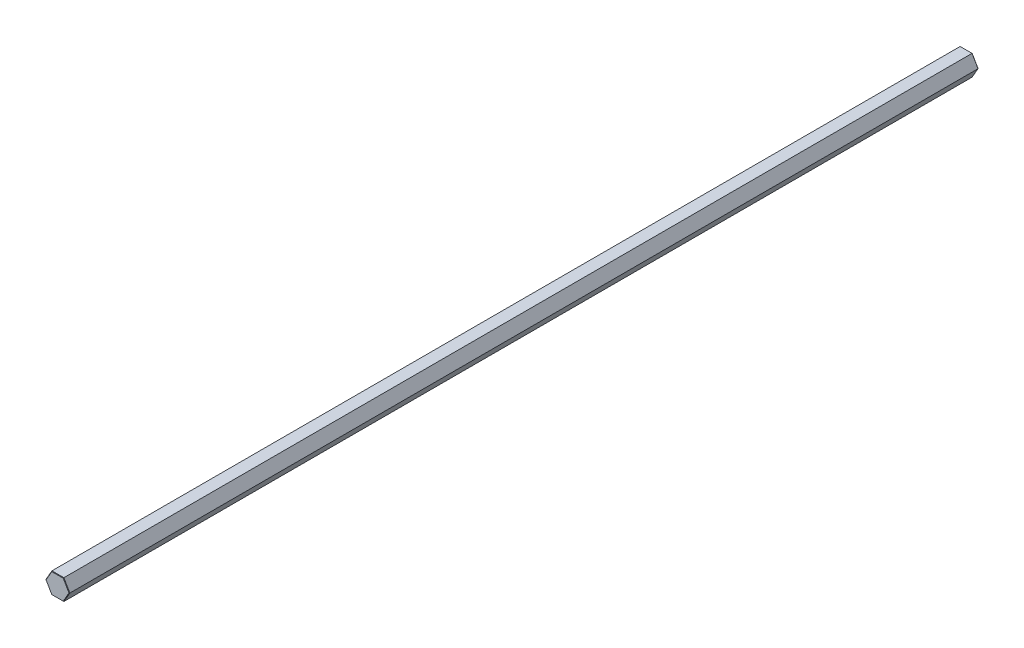
ISO-10303-21;
HEADER;
FILE_DESCRIPTION(('STEP AP214'),'2;1');
FILE_NAME('part.step','',(''),(''),'','','');
FILE_SCHEMA(('AUTOMOTIVE_DESIGN { 1 0 10303 214 1 1 1 1 }'));
ENDSEC;
DATA;
#1=APPLICATION_CONTEXT('core data for automotive mechanical design processes');
#2=APPLICATION_PROTOCOL_DEFINITION('international standard','automotive_design',2000,#1);
#3=PRODUCT_CONTEXT('',#1,'mechanical');
#4=PRODUCT('Part','Part','',(#3));
#5=PRODUCT_RELATED_PRODUCT_CATEGORY('part','',(#4));
#6=PRODUCT_DEFINITION_FORMATION('','',#4);
#7=PRODUCT_DEFINITION_CONTEXT('part definition',#1,'design');
#8=PRODUCT_DEFINITION('design','',#6,#7);
#9=PRODUCT_DEFINITION_SHAPE('','',#8);
#10=(LENGTH_UNIT() NAMED_UNIT(*) SI_UNIT(.MILLI.,.METRE.));
#11=(NAMED_UNIT(*) PLANE_ANGLE_UNIT() SI_UNIT($,.RADIAN.));
#12=(NAMED_UNIT(*) SI_UNIT($,.STERADIAN.) SOLID_ANGLE_UNIT());
#13=UNCERTAINTY_MEASURE_WITH_UNIT(LENGTH_MEASURE(1.E-05),#10,'distance_accuracy_value','');
#14=(GEOMETRIC_REPRESENTATION_CONTEXT(3) GLOBAL_UNCERTAINTY_ASSIGNED_CONTEXT((#13)) GLOBAL_UNIT_ASSIGNED_CONTEXT((#10,
#11,#12)) REPRESENTATION_CONTEXT('',''));
#15=CARTESIAN_POINT('',(0.,0.,0.));
#16=DIRECTION('',(0.,0.,1.));
#17=DIRECTION('',(1.,0.,0.));
#18=AXIS2_PLACEMENT_3D('',#15,#16,#17);
#19=CARTESIAN_POINT('',(-7.33234841870824,0.,558.8));
#20=DIRECTION('',(-0.866025403784439,0.5,0.));
#21=DIRECTION('',(-0.5,-0.866025403784439,0.));
#22=AXIS2_PLACEMENT_3D('',#19,#20,#21);
#23=PLANE('',#22);
#24=DIRECTION('',(0.,0.,-1.));
#25=VECTOR('',#24,1.);
#26=CARTESIAN_POINT('',(-3.66617420935412,6.35,558.8));
#27=LINE('',#26,#25);
#28=CARTESIAN_POINT('',(-3.66617420935412,6.35,558.546));
#29=VERTEX_POINT('',#28);
#30=CARTESIAN_POINT('',(-3.66617420935412,6.35,0.253999999999976));
#31=VERTEX_POINT('',#30);
#32=EDGE_CURVE('E157',#29,#31,#27,.T.);
#33=ORIENTED_EDGE('',*,*,#32,.T.);
#34=DIRECTION('',(-0.5,-0.866025403784439,0.));
#35=VECTOR('',#34,1.);
#36=CARTESIAN_POINT('',(-7.33234841870824,0.,0.253999999999976));
#37=LINE('',#36,#35);
#38=CARTESIAN_POINT('',(-7.33234841870824,0.,0.253999999999976));
#39=VERTEX_POINT('',#38);
#40=EDGE_CURVE('E154',#31,#39,#37,.T.);
#41=ORIENTED_EDGE('',*,*,#40,.T.);
#42=DIRECTION('',(0.,0.,-1.));
#43=VECTOR('',#42,1.);
#44=CARTESIAN_POINT('',(-7.33234841870824,0.,558.8));
#45=LINE('',#44,#43);
#46=CARTESIAN_POINT('',(-7.33234841870824,0.,558.546));
#47=VERTEX_POINT('',#46);
#48=EDGE_CURVE('E151',#47,#39,#45,.T.);
#49=ORIENTED_EDGE('',*,*,#48,.F.);
#50=DIRECTION('',(0.5,0.866025403784439,0.));
#51=VECTOR('',#50,1.);
#52=CARTESIAN_POINT('',(-3.66617420935412,6.35,558.546));
#53=LINE('',#52,#51);
#54=EDGE_CURVE('E211',#47,#29,#53,.T.);
#55=ORIENTED_EDGE('',*,*,#54,.T.);
#56=EDGE_LOOP('',(#33,#41,#49,#55));
#57=FACE_BOUND('',#56,.T.);
#58=ADVANCED_FACE('F36',(#57),#23,.T.);
#59=CARTESIAN_POINT('',(-3.66617420935412,-6.35,558.8));
#60=DIRECTION('',(-0.866025403784439,-0.5,0.));
#61=DIRECTION('',(0.5,-0.866025403784439,0.));
#62=AXIS2_PLACEMENT_3D('',#59,#60,#61);
#63=PLANE('',#62);
#64=ORIENTED_EDGE('',*,*,#48,.T.);
#65=DIRECTION('',(0.5,-0.866025403784439,0.));
#66=VECTOR('',#65,1.);
#67=CARTESIAN_POINT('',(-3.66617420935412,-6.35,0.253999999999976));
#68=LINE('',#67,#66);
#69=CARTESIAN_POINT('',(-3.66617420935412,-6.35,0.253999999999976));
#70=VERTEX_POINT('',#69);
#71=EDGE_CURVE('E195',#39,#70,#68,.T.);
#72=ORIENTED_EDGE('',*,*,#71,.T.);
#73=DIRECTION('',(0.,0.,-1.));
#74=VECTOR('',#73,1.);
#75=CARTESIAN_POINT('',(-3.66617420935412,-6.35,558.8));
#76=LINE('',#75,#74);
#77=CARTESIAN_POINT('',(-3.66617420935412,-6.35,558.546));
#78=VERTEX_POINT('',#77);
#79=EDGE_CURVE('E274',#78,#70,#76,.T.);
#80=ORIENTED_EDGE('',*,*,#79,.F.);
#81=DIRECTION('',(-0.5,0.866025403784439,0.));
#82=VECTOR('',#81,1.);
#83=CARTESIAN_POINT('',(-7.33234841870824,0.,558.546));
#84=LINE('',#83,#82);
#85=EDGE_CURVE('E201',#78,#47,#84,.T.);
#86=ORIENTED_EDGE('',*,*,#85,.T.);
#87=EDGE_LOOP('',(#64,#72,#80,#86));
#88=FACE_BOUND('',#87,.T.);
#89=ADVANCED_FACE('F277',(#88),#63,.T.);
#90=CARTESIAN_POINT('',(3.66617420935413,-6.35,558.8));
#91=DIRECTION('',(0.,-1.,0.));
#92=DIRECTION('',(0.,0.,-1.));
#93=AXIS2_PLACEMENT_3D('',#90,#91,#92);
#94=PLANE('',#93);
#95=ORIENTED_EDGE('',*,*,#79,.T.);
#96=DIRECTION('',(1.,0.,0.));
#97=VECTOR('',#96,1.);
#98=CARTESIAN_POINT('',(3.66617420935413,-6.35,0.253999999999976));
#99=LINE('',#98,#97);
#100=CARTESIAN_POINT('',(3.66617420935413,-6.35,0.253999999999976));
#101=VERTEX_POINT('',#100);
#102=EDGE_CURVE('E234',#70,#101,#99,.T.);
#103=ORIENTED_EDGE('',*,*,#102,.T.);
#104=DIRECTION('',(0.,0.,-1.));
#105=VECTOR('',#104,1.);
#106=CARTESIAN_POINT('',(3.66617420935413,-6.35,558.8));
#107=LINE('',#106,#105);
#108=CARTESIAN_POINT('',(3.66617420935413,-6.35,558.546));
#109=VERTEX_POINT('',#108);
#110=EDGE_CURVE('E251',#109,#101,#107,.T.);
#111=ORIENTED_EDGE('',*,*,#110,.F.);
#112=DIRECTION('',(-1.,0.,0.));
#113=VECTOR('',#112,1.);
#114=CARTESIAN_POINT('',(-3.66617420935412,-6.35,558.546));
#115=LINE('',#114,#113);
#116=EDGE_CURVE('E231',#109,#78,#115,.T.);
#117=ORIENTED_EDGE('',*,*,#116,.T.);
#118=EDGE_LOOP('',(#95,#103,#111,#117));
#119=FACE_BOUND('',#118,.T.);
#120=ADVANCED_FACE('F302',(#119),#94,.T.);
#121=CARTESIAN_POINT('',(7.33234841870825,0.,558.8));
#122=DIRECTION('',(0.866025403784439,-0.5,0.));
#123=DIRECTION('',(0.5,0.866025403784439,0.));
#124=AXIS2_PLACEMENT_3D('',#121,#122,#123);
#125=PLANE('',#124);
#126=ORIENTED_EDGE('',*,*,#110,.T.);
#127=DIRECTION('',(0.5,0.866025403784439,0.));
#128=VECTOR('',#127,1.);
#129=CARTESIAN_POINT('',(7.33234841870825,0.,0.253999999999976));
#130=LINE('',#129,#128);
#131=CARTESIAN_POINT('',(7.33234841870825,0.,0.253999999999976));
#132=VERTEX_POINT('',#131);
#133=EDGE_CURVE('E206',#101,#132,#130,.T.);
#134=ORIENTED_EDGE('',*,*,#133,.T.);
#135=DIRECTION('',(0.,0.,-1.));
#136=VECTOR('',#135,1.);
#137=CARTESIAN_POINT('',(7.33234841870825,0.,558.8));
#138=LINE('',#137,#136);
#139=CARTESIAN_POINT('',(7.33234841870825,0.,558.546));
#140=VERTEX_POINT('',#139);
#141=EDGE_CURVE('E250',#140,#132,#138,.T.);
#142=ORIENTED_EDGE('',*,*,#141,.F.);
#143=DIRECTION('',(-0.5,-0.866025403784439,0.));
#144=VECTOR('',#143,1.);
#145=CARTESIAN_POINT('',(3.66617420935413,-6.35,558.546));
#146=LINE('',#145,#144);
#147=EDGE_CURVE('E238',#140,#109,#146,.T.);
#148=ORIENTED_EDGE('',*,*,#147,.T.);
#149=EDGE_LOOP('',(#126,#134,#142,#148));
#150=FACE_BOUND('',#149,.T.);
#151=ADVANCED_FACE('F249',(#150),#125,.T.);
#152=CARTESIAN_POINT('',(3.66617420935413,6.35,558.8));
#153=DIRECTION('',(0.866025403784439,0.5,0.));
#154=DIRECTION('',(-0.5,0.866025403784439,0.));
#155=AXIS2_PLACEMENT_3D('',#152,#153,#154);
#156=PLANE('',#155);
#157=ORIENTED_EDGE('',*,*,#141,.T.);
#158=DIRECTION('',(-0.5,0.866025403784439,0.));
#159=VECTOR('',#158,1.);
#160=CARTESIAN_POINT('',(3.66617420935413,6.35,0.253999999999976));
#161=LINE('',#160,#159);
#162=CARTESIAN_POINT('',(3.66617420935413,6.35,0.253999999999976));
#163=VERTEX_POINT('',#162);
#164=EDGE_CURVE('E203',#132,#163,#161,.T.);
#165=ORIENTED_EDGE('',*,*,#164,.T.);
#166=DIRECTION('',(0.,0.,-1.));
#167=VECTOR('',#166,1.);
#168=CARTESIAN_POINT('',(3.66617420935413,6.35,558.8));
#169=LINE('',#168,#167);
#170=CARTESIAN_POINT('',(3.66617420935413,6.35,558.546));
#171=VERTEX_POINT('',#170);
#172=EDGE_CURVE('E260',#171,#163,#169,.T.);
#173=ORIENTED_EDGE('',*,*,#172,.F.);
#174=DIRECTION('',(0.5,-0.866025403784439,0.));
#175=VECTOR('',#174,1.);
#176=CARTESIAN_POINT('',(7.33234841870825,0.,558.546));
#177=LINE('',#176,#175);
#178=EDGE_CURVE('E200',#171,#140,#177,.T.);
#179=ORIENTED_EDGE('',*,*,#178,.T.);
#180=EDGE_LOOP('',(#157,#165,#173,#179));
#181=FACE_BOUND('',#180,.T.);
#182=ADVANCED_FACE('F256',(#181),#156,.T.);
#183=CARTESIAN_POINT('',(-3.66617420935412,6.35,558.8));
#184=DIRECTION('',(0.,1.,0.));
#185=DIRECTION('',(0.,0.,1.));
#186=AXIS2_PLACEMENT_3D('',#183,#184,#185);
#187=PLANE('',#186);
#188=ORIENTED_EDGE('',*,*,#172,.T.);
#189=DIRECTION('',(-1.,0.,0.));
#190=VECTOR('',#189,1.);
#191=CARTESIAN_POINT('',(-3.66617420935412,6.35,0.253999999999976));
#192=LINE('',#191,#190);
#193=EDGE_CURVE('E216',#163,#31,#192,.T.);
#194=ORIENTED_EDGE('',*,*,#193,.T.);
#195=ORIENTED_EDGE('',*,*,#32,.F.);
#196=DIRECTION('',(1.,0.,0.));
#197=VECTOR('',#196,1.);
#198=CARTESIAN_POINT('',(3.66617420935413,6.35,558.546));
#199=LINE('',#198,#197);
#200=EDGE_CURVE('E214',#29,#171,#199,.T.);
#201=ORIENTED_EDGE('',*,*,#200,.T.);
#202=EDGE_LOOP('',(#188,#194,#195,#201));
#203=FACE_BOUND('',#202,.T.);
#204=ADVANCED_FACE('F282',(#203),#187,.T.);
#205=CARTESIAN_POINT('',(0.,0.,558.8));
#206=DIRECTION('',(0.,0.,-1.));
#207=DIRECTION('',(-1.,0.,0.));
#208=AXIS2_PLACEMENT_3D('',#205,#206,#207);
#209=PLANE('',#208);
#210=DIRECTION('',(-0.5,-0.866025403784439,0.));
#211=VECTOR('',#210,1.);
#212=CARTESIAN_POINT('',(-7.11237796614707,-0.126999999999954,558.8));
#213=LINE('',#212,#211);
#214=CARTESIAN_POINT('',(-3.51952724098,6.09600000000009,558.8));
#215=VERTEX_POINT('',#214);
#216=CARTESIAN_POINT('',(-7.03905448196001,0.,558.8));
#217=VERTEX_POINT('',#216);
#218=EDGE_CURVE('E61',#215,#217,#213,.T.);
#219=ORIENTED_EDGE('',*,*,#218,.T.);
#220=DIRECTION('',(0.5,-0.866025403784439,0.));
#221=VECTOR('',#220,1.);
#222=CARTESIAN_POINT('',(-3.44620375679295,-6.22300000000004,558.8));
#223=LINE('',#222,#221);
#224=CARTESIAN_POINT('',(-3.51952724098,-6.09600000000009,558.8));
#225=VERTEX_POINT('',#224);
#226=EDGE_CURVE('E11',#217,#225,#223,.T.);
#227=ORIENTED_EDGE('',*,*,#226,.T.);
#228=DIRECTION('',(1.,0.,0.));
#229=VECTOR('',#228,1.);
#230=CARTESIAN_POINT('',(3.66617420935413,-6.09600000000009,558.8));
#231=LINE('',#230,#229);
#232=CARTESIAN_POINT('',(3.51952724098001,-6.09600000000009,558.8));
#233=VERTEX_POINT('',#232);
#234=EDGE_CURVE('E46',#225,#233,#231,.T.);
#235=ORIENTED_EDGE('',*,*,#234,.T.);
#236=DIRECTION('',(0.5,0.866025403784439,0.));
#237=VECTOR('',#236,1.);
#238=CARTESIAN_POINT('',(7.11237796614708,0.12699999999996,558.8));
#239=LINE('',#238,#237);
#240=CARTESIAN_POINT('',(7.03905448196002,0.,558.8));
#241=VERTEX_POINT('',#240);
#242=EDGE_CURVE('E222',#233,#241,#239,.T.);
#243=ORIENTED_EDGE('',*,*,#242,.T.);
#244=DIRECTION('',(-0.5,0.866025403784439,0.));
#245=VECTOR('',#244,1.);
#246=CARTESIAN_POINT('',(3.44620375679296,6.22300000000004,558.8));
#247=LINE('',#246,#245);
#248=CARTESIAN_POINT('',(3.51952724098001,6.09600000000009,558.8));
#249=VERTEX_POINT('',#248);
#250=EDGE_CURVE('E218',#241,#249,#247,.T.);
#251=ORIENTED_EDGE('',*,*,#250,.T.);
#252=DIRECTION('',(-1.,0.,0.));
#253=VECTOR('',#252,1.);
#254=CARTESIAN_POINT('',(-3.66617420935412,6.09600000000009,558.8));
#255=LINE('',#254,#253);
#256=EDGE_CURVE('E220',#249,#215,#255,.T.);
#257=ORIENTED_EDGE('',*,*,#256,.T.);
#258=EDGE_LOOP('',(#219,#227,#235,#243,#251,#257));
#259=FACE_BOUND('',#258,.T.);
#260=ADVANCED_FACE('F224',(#259),#209,.F.);
#261=CARTESIAN_POINT('',(0.,0.,0.));
#262=DIRECTION('',(0.,0.,-1.));
#263=DIRECTION('',(-1.,0.,0.));
#264=AXIS2_PLACEMENT_3D('',#261,#262,#263);
#265=PLANE('',#264);
#266=DIRECTION('',(-0.5,-0.866025403784439,0.));
#267=VECTOR('',#266,1.);
#268=CARTESIAN_POINT('',(5.27929086146986,-3.04799999999996,0.));
#269=LINE('',#268,#267);
#270=CARTESIAN_POINT('',(7.03905448195982,0.,0.));
#271=VERTEX_POINT('',#270);
#272=CARTESIAN_POINT('',(3.51952724097991,-6.09599999999991,0.));
#273=VERTEX_POINT('',#272);
#274=EDGE_CURVE('E240',#271,#273,#269,.T.);
#275=ORIENTED_EDGE('',*,*,#274,.T.);
#276=DIRECTION('',(-1.,0.,0.));
#277=VECTOR('',#276,1.);
#278=CARTESIAN_POINT('',(0.,-6.09599999999991,0.));
#279=LINE('',#278,#277);
#280=CARTESIAN_POINT('',(-3.5195272409799,-6.09599999999991,0.));
#281=VERTEX_POINT('',#280);
#282=EDGE_CURVE('E235',#273,#281,#279,.T.);
#283=ORIENTED_EDGE('',*,*,#282,.T.);
#284=DIRECTION('',(-0.5,0.866025403784439,0.));
#285=VECTOR('',#284,1.);
#286=CARTESIAN_POINT('',(-5.27929086146986,-3.04799999999995,0.));
#287=LINE('',#286,#285);
#288=CARTESIAN_POINT('',(-7.03905448195981,0.,0.));
#289=VERTEX_POINT('',#288);
#290=EDGE_CURVE('E135',#281,#289,#287,.T.);
#291=ORIENTED_EDGE('',*,*,#290,.T.);
#292=DIRECTION('',(0.5,0.866025403784439,0.));
#293=VECTOR('',#292,1.);
#294=CARTESIAN_POINT('',(-5.27929086146986,3.04799999999995,0.));
#295=LINE('',#294,#293);
#296=CARTESIAN_POINT('',(-3.5195272409799,6.09599999999991,0.));
#297=VERTEX_POINT('',#296);
#298=EDGE_CURVE('E128',#289,#297,#295,.T.);
#299=ORIENTED_EDGE('',*,*,#298,.T.);
#300=DIRECTION('',(1.,0.,0.));
#301=VECTOR('',#300,1.);
#302=CARTESIAN_POINT('',(0.,6.09599999999991,0.));
#303=LINE('',#302,#301);
#304=CARTESIAN_POINT('',(3.51952724097991,6.09599999999991,0.));
#305=VERTEX_POINT('',#304);
#306=EDGE_CURVE('E131',#297,#305,#303,.T.);
#307=ORIENTED_EDGE('',*,*,#306,.T.);
#308=DIRECTION('',(0.5,-0.866025403784439,0.));
#309=VECTOR('',#308,1.);
#310=CARTESIAN_POINT('',(5.27929086146986,3.04799999999996,0.));
#311=LINE('',#310,#309);
#312=EDGE_CURVE('E140',#305,#271,#311,.T.);
#313=ORIENTED_EDGE('',*,*,#312,.T.);
#314=EDGE_LOOP('',(#275,#283,#291,#299,#307,#313));
#315=FACE_BOUND('',#314,.T.);
#316=ADVANCED_FACE('F130',(#315),#265,.T.);
#317=CARTESIAN_POINT('',(0.,6.09599999999991,0.));
#318=DIRECTION('',(0.,-0.707106781186393,0.707106781186702));
#319=DIRECTION('',(1.,0.,0.));
#320=AXIS2_PLACEMENT_3D('',#317,#318,#319);
#321=PLANE('',#320);
#322=DIRECTION('',(-0.377964473009298,0.6546536707081,0.654653670707814));
#323=VECTOR('',#322,1.);
#324=CARTESIAN_POINT('',(-3.01673763512545,5.22514285714246,-0.870857142857074));
#325=LINE('',#324,#323);
#326=EDGE_CURVE('E146',#31,#297,#325,.F.);
#327=ORIENTED_EDGE('',*,*,#326,.F.);
#328=ORIENTED_EDGE('',*,*,#193,.F.);
#329=DIRECTION('',(-0.377964473009301,-0.654653670708099,-0.654653670707813));
#330=VECTOR('',#329,1.);
#331=CARTESIAN_POINT('',(3.01673763512544,5.22514285714245,-0.870857142857083));
#332=LINE('',#331,#330);
#333=EDGE_CURVE('E149',#305,#163,#332,.F.);
#334=ORIENTED_EDGE('',*,*,#333,.F.);
#335=ORIENTED_EDGE('',*,*,#306,.F.);
#336=EDGE_LOOP('',(#327,#328,#334,#335));
#337=FACE_BOUND('',#336,.T.);
#338=ADVANCED_FACE('F144',(#337),#321,.F.);
#339=CARTESIAN_POINT('',(5.27929086146986,3.04799999999996,0.));
#340=DIRECTION('',(-0.612372435695659,-0.353553390593195,0.707106781186704));
#341=DIRECTION('',(0.5,-0.866025403784439,0.));
#342=AXIS2_PLACEMENT_3D('',#339,#340,#341);
#343=PLANE('',#342);
#344=ORIENTED_EDGE('',*,*,#333,.T.);
#345=ORIENTED_EDGE('',*,*,#164,.F.);
#346=DIRECTION('',(-0.755928946018597,0.,-0.654653670707813));
#347=VECTOR('',#346,1.);
#348=CARTESIAN_POINT('',(6.0334752702509,0.,-0.870857142857067));
#349=LINE('',#348,#347);
#350=EDGE_CURVE('E155',#271,#132,#349,.F.);
#351=ORIENTED_EDGE('',*,*,#350,.F.);
#352=ORIENTED_EDGE('',*,*,#312,.F.);
#353=EDGE_LOOP('',(#344,#345,#351,#352));
#354=FACE_BOUND('',#353,.T.);
#355=ADVANCED_FACE('F264',(#354),#343,.F.);
#356=CARTESIAN_POINT('',(-5.27929086146986,3.04799999999995,0.));
#357=DIRECTION('',(0.612372435695661,-0.353553390593197,0.707106781186702));
#358=DIRECTION('',(0.5,0.866025403784439,0.));
#359=AXIS2_PLACEMENT_3D('',#356,#357,#358);
#360=PLANE('',#359);
#361=ORIENTED_EDGE('',*,*,#326,.T.);
#362=ORIENTED_EDGE('',*,*,#298,.F.);
#363=DIRECTION('',(-0.755928946018596,0.,0.654653670707813));
#364=VECTOR('',#363,1.);
#365=CARTESIAN_POINT('',(-6.03347527025088,0.,-0.870857142857078));
#366=LINE('',#365,#364);
#367=EDGE_CURVE('E160',#39,#289,#366,.F.);
#368=ORIENTED_EDGE('',*,*,#367,.F.);
#369=ORIENTED_EDGE('',*,*,#40,.F.);
#370=EDGE_LOOP('',(#361,#362,#368,#369));
#371=FACE_BOUND('',#370,.T.);
#372=ADVANCED_FACE('F153',(#371),#360,.F.);
#373=CARTESIAN_POINT('',(5.27929086146986,-3.04799999999996,0.));
#374=DIRECTION('',(-0.612372435695661,0.353553390593196,0.707106781186702));
#375=DIRECTION('',(-0.5,-0.866025403784439,0.));
#376=AXIS2_PLACEMENT_3D('',#373,#374,#375);
#377=PLANE('',#376);
#378=ORIENTED_EDGE('',*,*,#350,.T.);
#379=ORIENTED_EDGE('',*,*,#133,.F.);
#380=DIRECTION('',(-0.377964473009298,0.6546536707081,-0.654653670707814));
#381=VECTOR('',#380,1.);
#382=CARTESIAN_POINT('',(3.01673763512545,-5.22514285714245,-0.870857142857077));
#383=LINE('',#382,#381);
#384=EDGE_CURVE('E184',#273,#101,#383,.F.);
#385=ORIENTED_EDGE('',*,*,#384,.F.);
#386=ORIENTED_EDGE('',*,*,#274,.F.);
#387=EDGE_LOOP('',(#378,#379,#385,#386));
#388=FACE_BOUND('',#387,.T.);
#389=ADVANCED_FACE('F266',(#388),#377,.F.);
#390=CARTESIAN_POINT('',(-5.27929086146986,-3.04799999999995,0.));
#391=DIRECTION('',(0.61237243569566,0.353553390593196,0.707106781186703));
#392=DIRECTION('',(-0.5,0.866025403784439,0.));
#393=AXIS2_PLACEMENT_3D('',#390,#391,#392);
#394=PLANE('',#393);
#395=ORIENTED_EDGE('',*,*,#367,.T.);
#396=ORIENTED_EDGE('',*,*,#290,.F.);
#397=DIRECTION('',(-0.3779644730093,-0.654653670708099,0.654653670707813));
#398=VECTOR('',#397,1.);
#399=CARTESIAN_POINT('',(-3.01673763512544,-5.22514285714246,-0.870857142857073));
#400=LINE('',#399,#398);
#401=EDGE_CURVE('E179',#70,#281,#400,.F.);
#402=ORIENTED_EDGE('',*,*,#401,.F.);
#403=ORIENTED_EDGE('',*,*,#71,.F.);
#404=EDGE_LOOP('',(#395,#396,#402,#403));
#405=FACE_BOUND('',#404,.T.);
#406=ADVANCED_FACE('F194',(#405),#394,.F.);
#407=CARTESIAN_POINT('',(0.,-6.09599999999991,0.));
#408=DIRECTION('',(0.,0.707106781186393,0.707106781186702));
#409=DIRECTION('',(-1.,0.,0.));
#410=AXIS2_PLACEMENT_3D('',#407,#408,#409);
#411=PLANE('',#410);
#412=ORIENTED_EDGE('',*,*,#384,.T.);
#413=ORIENTED_EDGE('',*,*,#102,.F.);
#414=ORIENTED_EDGE('',*,*,#401,.T.);
#415=ORIENTED_EDGE('',*,*,#282,.F.);
#416=EDGE_LOOP('',(#412,#413,#414,#415));
#417=FACE_BOUND('',#416,.T.);
#418=ADVANCED_FACE('F308',(#417),#411,.F.);
#419=CARTESIAN_POINT('',(3.66617420935413,6.35,558.546));
#420=DIRECTION('',(0.61237243569587,0.353553390593317,0.70710678118646));
#421=DIRECTION('',(-0.5,0.866025403784439,0.));
#422=AXIS2_PLACEMENT_3D('',#419,#420,#421);
#423=PLANE('',#422);
#424=DIRECTION('',(-0.37796447300919,-0.654653670707905,0.65465367070807));
#425=VECTOR('',#424,1.);
#426=CARTESIAN_POINT('',(3.66617420935413,6.35,558.546));
#427=LINE('',#426,#425);
#428=EDGE_CURVE('E172',#249,#171,#427,.F.);
#429=ORIENTED_EDGE('',*,*,#428,.F.);
#430=ORIENTED_EDGE('',*,*,#250,.F.);
#431=DIRECTION('',(0.755928946018373,0.,-0.654653670708071));
#432=VECTOR('',#431,1.);
#433=CARTESIAN_POINT('',(5.23739172764922,0.,560.360285714286));
#434=LINE('',#433,#432);
#435=EDGE_CURVE('E41',#140,#241,#434,.F.);
#436=ORIENTED_EDGE('',*,*,#435,.F.);
#437=ORIENTED_EDGE('',*,*,#178,.F.);
#438=EDGE_LOOP('',(#429,#430,#436,#437));
#439=FACE_BOUND('',#438,.T.);
#440=ADVANCED_FACE('F39',(#439),#423,.T.);
#441=CARTESIAN_POINT('',(7.33234841870825,0.,558.546));
#442=DIRECTION('',(0.612372435695872,-0.353553390593318,0.707106781186458));
#443=DIRECTION('',(0.5,0.866025403784439,0.));
#444=AXIS2_PLACEMENT_3D('',#441,#442,#443);
#445=PLANE('',#444);
#446=ORIENTED_EDGE('',*,*,#435,.T.);
#447=ORIENTED_EDGE('',*,*,#242,.F.);
#448=DIRECTION('',(0.377964473009185,-0.654653670707908,-0.654653670708071));
#449=VECTOR('',#448,1.);
#450=CARTESIAN_POINT('',(2.6186958638246,-4.53571428571466,560.360285714286));
#451=LINE('',#450,#449);
#452=EDGE_CURVE('E170',#109,#233,#451,.F.);
#453=ORIENTED_EDGE('',*,*,#452,.F.);
#454=ORIENTED_EDGE('',*,*,#147,.F.);
#455=EDGE_LOOP('',(#446,#447,#453,#454));
#456=FACE_BOUND('',#455,.T.);
#457=ADVANCED_FACE('F228',(#456),#445,.T.);
#458=CARTESIAN_POINT('',(-3.66617420935412,6.35,558.546));
#459=DIRECTION('',(0.,0.707106781186637,0.707106781186458));
#460=DIRECTION('',(-1.,0.,0.));
#461=AXIS2_PLACEMENT_3D('',#458,#459,#460);
#462=PLANE('',#461);
#463=ORIENTED_EDGE('',*,*,#428,.T.);
#464=ORIENTED_EDGE('',*,*,#200,.F.);
#465=DIRECTION('',(0.377964473009186,-0.654653670707906,0.654653670708072));
#466=VECTOR('',#465,1.);
#467=CARTESIAN_POINT('',(-3.66617420935412,6.35,558.546));
#468=LINE('',#467,#466);
#469=EDGE_CURVE('E167',#215,#29,#468,.F.);
#470=ORIENTED_EDGE('',*,*,#469,.F.);
#471=ORIENTED_EDGE('',*,*,#256,.F.);
#472=EDGE_LOOP('',(#463,#464,#470,#471));
#473=FACE_BOUND('',#472,.T.);
#474=ADVANCED_FACE('F284',(#473),#462,.T.);
#475=CARTESIAN_POINT('',(3.66617420935413,-6.35,558.546));
#476=DIRECTION('',(0.,-0.707106781186636,0.707106781186459));
#477=DIRECTION('',(1.,0.,0.));
#478=AXIS2_PLACEMENT_3D('',#475,#476,#477);
#479=PLANE('',#478);
#480=ORIENTED_EDGE('',*,*,#452,.T.);
#481=ORIENTED_EDGE('',*,*,#234,.F.);
#482=DIRECTION('',(-0.377964473009186,-0.654653670707907,-0.654653670708071));
#483=VECTOR('',#482,1.);
#484=CARTESIAN_POINT('',(-2.6186958638246,-4.53571428571468,560.360285714286));
#485=LINE('',#484,#483);
#486=EDGE_CURVE('E54',#78,#225,#485,.F.);
#487=ORIENTED_EDGE('',*,*,#486,.F.);
#488=ORIENTED_EDGE('',*,*,#116,.F.);
#489=EDGE_LOOP('',(#480,#481,#487,#488));
#490=FACE_BOUND('',#489,.T.);
#491=ADVANCED_FACE('F230',(#490),#479,.T.);
#492=CARTESIAN_POINT('',(-7.33234841870824,0.,558.546));
#493=DIRECTION('',(-0.612372435695872,0.353553390593319,0.707106781186458));
#494=DIRECTION('',(-0.5,-0.866025403784439,0.));
#495=AXIS2_PLACEMENT_3D('',#492,#493,#494);
#496=PLANE('',#495);
#497=ORIENTED_EDGE('',*,*,#469,.T.);
#498=ORIENTED_EDGE('',*,*,#54,.F.);
#499=DIRECTION('',(0.755928946018373,0.,0.654653670708071));
#500=VECTOR('',#499,1.);
#501=CARTESIAN_POINT('',(-7.33234841870824,0.,558.546));
#502=LINE('',#501,#500);
#503=EDGE_CURVE('E164',#217,#47,#502,.F.);
#504=ORIENTED_EDGE('',*,*,#503,.F.);
#505=ORIENTED_EDGE('',*,*,#218,.F.);
#506=EDGE_LOOP('',(#497,#498,#504,#505));
#507=FACE_BOUND('',#506,.T.);
#508=ADVANCED_FACE('F286',(#507),#496,.T.);
#509=CARTESIAN_POINT('',(-3.66617420935412,-6.35,558.546));
#510=DIRECTION('',(-0.612372435695871,-0.353553390593318,0.707106781186459));
#511=DIRECTION('',(0.5,-0.866025403784439,0.));
#512=AXIS2_PLACEMENT_3D('',#509,#510,#511);
#513=PLANE('',#512);
#514=ORIENTED_EDGE('',*,*,#486,.T.);
#515=ORIENTED_EDGE('',*,*,#226,.F.);
#516=ORIENTED_EDGE('',*,*,#503,.T.);
#517=ORIENTED_EDGE('',*,*,#85,.F.);
#518=EDGE_LOOP('',(#514,#515,#516,#517));
#519=FACE_BOUND('',#518,.T.);
#520=ADVANCED_FACE('F288',(#519),#513,.T.);
#521=CLOSED_SHELL('',(#58,#89,#120,#151,#182,#204,#260,#316,#338,#355,#372,#389,#406,#418,#440,
#457,#474,#491,#508,#520));
#522=MANIFOLD_SOLID_BREP('B2',#521);
#523=ADVANCED_BREP_SHAPE_REPRESENTATION('',(#18,#522),#14);
#524=SHAPE_DEFINITION_REPRESENTATION(#9,#523);
ENDSEC;
END-ISO-10303-21;
